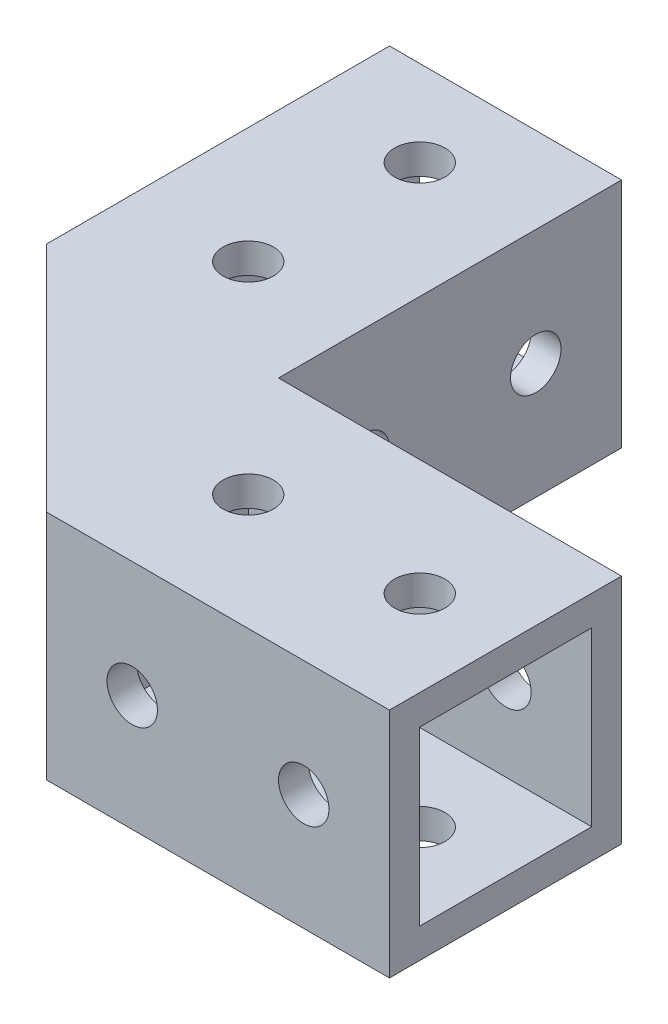
ISO-10303-21;
HEADER;
FILE_DESCRIPTION(('STEP AP214'),'2;1');
FILE_NAME('part.step','',(''),(''),'','','');
FILE_SCHEMA(('AUTOMOTIVE_DESIGN { 1 0 10303 214 1 1 1 1 }'));
ENDSEC;
DATA;
#1=APPLICATION_CONTEXT('core data for automotive mechanical design processes');
#2=APPLICATION_PROTOCOL_DEFINITION('international standard','automotive_design',2000,#1);
#3=PRODUCT_CONTEXT('',#1,'mechanical');
#4=PRODUCT('Part','Part','',(#3));
#5=PRODUCT_RELATED_PRODUCT_CATEGORY('part','',(#4));
#6=PRODUCT_DEFINITION_FORMATION('','',#4);
#7=PRODUCT_DEFINITION_CONTEXT('part definition',#1,'design');
#8=PRODUCT_DEFINITION('design','',#6,#7);
#9=PRODUCT_DEFINITION_SHAPE('','',#8);
#10=(LENGTH_UNIT() NAMED_UNIT(*) SI_UNIT(.MILLI.,.METRE.));
#11=(NAMED_UNIT(*) PLANE_ANGLE_UNIT() SI_UNIT($,.RADIAN.));
#12=(NAMED_UNIT(*) SI_UNIT($,.STERADIAN.) SOLID_ANGLE_UNIT());
#13=UNCERTAINTY_MEASURE_WITH_UNIT(LENGTH_MEASURE(1.E-05),#10,'distance_accuracy_value','');
#14=(GEOMETRIC_REPRESENTATION_CONTEXT(3) GLOBAL_UNCERTAINTY_ASSIGNED_CONTEXT((#13)) GLOBAL_UNIT_ASSIGNED_CONTEXT((#10,
#11,#12)) REPRESENTATION_CONTEXT('',''));
#15=CARTESIAN_POINT('',(0.,0.,0.));
#16=DIRECTION('',(0.,0.,1.));
#17=DIRECTION('',(1.,0.,0.));
#18=AXIS2_PLACEMENT_3D('',#15,#16,#17);
#19=CARTESIAN_POINT('',(0.,23.,0.));
#20=DIRECTION('',(0.,0.,1.));
#21=DIRECTION('',(1.,0.,0.));
#22=AXIS2_PLACEMENT_3D('',#19,#20,#21);
#23=PLANE('',#22);
#24=CARTESIAN_POINT('',(8.49999999999997,11.5,0.));
#25=DIRECTION('',(0.,0.,-1.));
#26=DIRECTION('',(-1.,0.,0.));
#27=AXIS2_PLACEMENT_3D('',#24,#25,#26);
#28=CIRCLE('',#27,2.5);
#29=CARTESIAN_POINT('',(5.99999999999997,11.5,0.));
#30=VERTEX_POINT('',#29);
#31=EDGE_CURVE('E368',#30,#30,#28,.T.);
#32=ORIENTED_EDGE('',*,*,#31,.F.);
#33=EDGE_LOOP('',(#32));
#34=FACE_BOUND('',#33,.T.);
#35=CARTESIAN_POINT('',(25.5,11.5,0.));
#36=DIRECTION('',(0.,0.,-1.));
#37=DIRECTION('',(-1.,0.,0.));
#38=AXIS2_PLACEMENT_3D('',#35,#36,#37);
#39=CIRCLE('',#38,2.5);
#40=CARTESIAN_POINT('',(23.,11.5,0.));
#41=VERTEX_POINT('',#40);
#42=EDGE_CURVE('E371',#41,#41,#39,.T.);
#43=ORIENTED_EDGE('',*,*,#42,.F.);
#44=EDGE_LOOP('',(#43));
#45=FACE_BOUND('',#44,.T.);
#46=DIRECTION('',(1.,0.,0.));
#47=VECTOR('',#46,1.);
#48=CARTESIAN_POINT('',(0.,4.,0.));
#49=LINE('',#48,#47);
#50=CARTESIAN_POINT('',(0.,4.,0.));
#51=VERTEX_POINT('',#50);
#52=CARTESIAN_POINT('',(17.,4.,0.));
#53=VERTEX_POINT('',#52);
#54=EDGE_CURVE('E180',#51,#53,#49,.T.);
#55=ORIENTED_EDGE('',*,*,#54,.F.);
#56=DIRECTION('',(0.,-1.,0.));
#57=VECTOR('',#56,1.);
#58=CARTESIAN_POINT('',(0.,23.,0.));
#59=LINE('',#58,#57);
#60=CARTESIAN_POINT('',(0.,23.,0.));
#61=VERTEX_POINT('',#60);
#62=EDGE_CURVE('E289',#61,#51,#59,.T.);
#63=ORIENTED_EDGE('',*,*,#62,.F.);
#64=DIRECTION('',(-1.,0.,0.));
#65=VECTOR('',#64,1.);
#66=CARTESIAN_POINT('',(0.,23.,0.));
#67=LINE('',#66,#65);
#68=CARTESIAN_POINT('',(34.,23.,0.));
#69=VERTEX_POINT('',#68);
#70=EDGE_CURVE('E396',#69,#61,#67,.T.);
#71=ORIENTED_EDGE('',*,*,#70,.F.);
#72=DIRECTION('',(0.,-1.,0.));
#73=VECTOR('',#72,1.);
#74=CARTESIAN_POINT('',(34.,23.,0.));
#75=LINE('',#74,#73);
#76=CARTESIAN_POINT('',(34.,0.,0.));
#77=VERTEX_POINT('',#76);
#78=EDGE_CURVE('E399',#69,#77,#75,.T.);
#79=ORIENTED_EDGE('',*,*,#78,.T.);
#80=DIRECTION('',(-1.,0.,0.));
#81=VECTOR('',#80,1.);
#82=CARTESIAN_POINT('',(0.,0.,0.));
#83=LINE('',#82,#81);
#84=CARTESIAN_POINT('',(17.,0.,0.));
#85=VERTEX_POINT('',#84);
#86=EDGE_CURVE('E67',#77,#85,#83,.T.);
#87=ORIENTED_EDGE('',*,*,#86,.T.);
#88=DIRECTION('',(0.,-1.,0.));
#89=VECTOR('',#88,1.);
#90=CARTESIAN_POINT('',(17.,4.,0.));
#91=LINE('',#90,#89);
#92=EDGE_CURVE('E62',#53,#85,#91,.T.);
#93=ORIENTED_EDGE('',*,*,#92,.F.);
#94=EDGE_LOOP('',(#55,#63,#71,#79,#87,#93));
#95=FACE_BOUND('',#94,.T.);
#96=ADVANCED_FACE('F45',(#34,#45,#95),#23,.F.);
#97=CARTESIAN_POINT('',(0.,23.,0.));
#98=DIRECTION('',(-1.,0.,0.));
#99=DIRECTION('',(0.,0.,-1.));
#100=AXIS2_PLACEMENT_3D('',#97,#98,#99);
#101=PLANE('',#100);
#102=CARTESIAN_POINT('',(-1.07580611086178E-13,11.5,-25.5));
#103=DIRECTION('',(-1.,0.,0.));
#104=DIRECTION('',(0.,0.,1.));
#105=AXIS2_PLACEMENT_3D('',#102,#103,#104);
#106=CIRCLE('',#105,2.5);
#107=CARTESIAN_POINT('',(0.,11.5,-23.));
#108=VERTEX_POINT('',#107);
#109=EDGE_CURVE('E258',#108,#108,#106,.T.);
#110=ORIENTED_EDGE('',*,*,#109,.T.);
#111=EDGE_LOOP('',(#110));
#112=FACE_BOUND('',#111,.T.);
#113=CARTESIAN_POINT('',(0.,11.5,-8.49999999999997));
#114=DIRECTION('',(-1.,0.,0.));
#115=DIRECTION('',(0.,0.,1.));
#116=AXIS2_PLACEMENT_3D('',#113,#114,#115);
#117=CIRCLE('',#116,2.5);
#118=CARTESIAN_POINT('',(0.,11.5,-5.99999999999997));
#119=VERTEX_POINT('',#118);
#120=EDGE_CURVE('E255',#119,#119,#117,.T.);
#121=ORIENTED_EDGE('',*,*,#120,.T.);
#122=EDGE_LOOP('',(#121));
#123=FACE_BOUND('',#122,.T.);
#124=DIRECTION('',(0.,0.,1.));
#125=VECTOR('',#124,1.);
#126=CARTESIAN_POINT('',(-1.43982048506075E-13,4.,-17.));
#127=LINE('',#126,#125);
#128=CARTESIAN_POINT('',(-1.43982048506075E-13,4.,-17.));
#129=VERTEX_POINT('',#128);
#130=EDGE_CURVE('E193',#129,#51,#127,.T.);
#131=ORIENTED_EDGE('',*,*,#130,.F.);
#132=DIRECTION('',(0.,-1.,0.));
#133=VECTOR('',#132,1.);
#134=CARTESIAN_POINT('',(-1.43982048506075E-13,4.,-17.));
#135=LINE('',#134,#133);
#136=CARTESIAN_POINT('',(0.,0.,-16.9999999999999));
#137=VERTEX_POINT('',#136);
#138=EDGE_CURVE('E190',#129,#137,#135,.T.);
#139=ORIENTED_EDGE('',*,*,#138,.T.);
#140=DIRECTION('',(0.,0.,1.));
#141=VECTOR('',#140,1.);
#142=CARTESIAN_POINT('',(0.,0.,0.));
#143=LINE('',#142,#141);
#144=CARTESIAN_POINT('',(-1.4344081478157E-13,0.,-34.));
#145=VERTEX_POINT('',#144);
#146=EDGE_CURVE('E283',#145,#137,#143,.T.);
#147=ORIENTED_EDGE('',*,*,#146,.F.);
#148=DIRECTION('',(0.,-1.,0.));
#149=VECTOR('',#148,1.);
#150=CARTESIAN_POINT('',(-1.4344081478157E-13,23.,-34.));
#151=LINE('',#150,#149);
#152=CARTESIAN_POINT('',(-1.4344081478157E-13,23.,-34.));
#153=VERTEX_POINT('',#152);
#154=EDGE_CURVE('E299',#153,#145,#151,.T.);
#155=ORIENTED_EDGE('',*,*,#154,.F.);
#156=DIRECTION('',(0.,0.,1.));
#157=VECTOR('',#156,1.);
#158=CARTESIAN_POINT('',(0.,23.,0.));
#159=LINE('',#158,#157);
#160=EDGE_CURVE('E286',#153,#61,#159,.T.);
#161=ORIENTED_EDGE('',*,*,#160,.T.);
#162=ORIENTED_EDGE('',*,*,#62,.T.);
#163=EDGE_LOOP('',(#131,#139,#147,#155,#161,#162));
#164=FACE_BOUND('',#163,.T.);
#165=ADVANCED_FACE('F450',(#112,#123,#164),#101,.F.);
#166=CARTESIAN_POINT('',(8.5,23.,11.5));
#167=DIRECTION('',(0.,-1.,0.));
#168=DIRECTION('',(0.,0.,-1.));
#169=AXIS2_PLACEMENT_3D('',#166,#167,#168);
#170=CYLINDRICAL_SURFACE('',#169,2.5);
#171=CARTESIAN_POINT('',(8.5,20.04,11.5));
#172=DIRECTION('',(0.,1.,0.));
#173=DIRECTION('',(0.,0.,1.));
#174=AXIS2_PLACEMENT_3D('',#171,#172,#173);
#175=CIRCLE('',#174,2.5);
#176=CARTESIAN_POINT('',(8.5,20.04,14.));
#177=VERTEX_POINT('',#176);
#178=EDGE_CURVE('E364',#177,#177,#175,.T.);
#179=ORIENTED_EDGE('',*,*,#178,.F.);
#180=EDGE_LOOP('',(#179));
#181=FACE_BOUND('',#180,.T.);
#182=CARTESIAN_POINT('',(8.5,23.,11.5));
#183=DIRECTION('',(0.,1.,0.));
#184=DIRECTION('',(0.,0.,1.));
#185=AXIS2_PLACEMENT_3D('',#182,#183,#184);
#186=CIRCLE('',#185,2.5);
#187=CARTESIAN_POINT('',(8.5,23.,14.));
#188=VERTEX_POINT('',#187);
#189=EDGE_CURVE('E386',#188,#188,#186,.T.);
#190=ORIENTED_EDGE('',*,*,#189,.T.);
#191=EDGE_LOOP('',(#190));
#192=FACE_BOUND('',#191,.T.);
#193=ADVANCED_FACE('F490',(#181,#192),#170,.F.);
#194=CARTESIAN_POINT('',(25.5,23.,11.5));
#195=DIRECTION('',(0.,-1.,0.));
#196=DIRECTION('',(0.,0.,-1.));
#197=AXIS2_PLACEMENT_3D('',#194,#195,#196);
#198=CYLINDRICAL_SURFACE('',#197,2.5);
#199=CARTESIAN_POINT('',(25.5,20.04,11.5));
#200=DIRECTION('',(0.,1.,0.));
#201=DIRECTION('',(0.,0.,1.));
#202=AXIS2_PLACEMENT_3D('',#199,#200,#201);
#203=CIRCLE('',#202,2.5);
#204=CARTESIAN_POINT('',(25.5,20.04,14.));
#205=VERTEX_POINT('',#204);
#206=EDGE_CURVE('E361',#205,#205,#203,.T.);
#207=ORIENTED_EDGE('',*,*,#206,.F.);
#208=EDGE_LOOP('',(#207));
#209=FACE_BOUND('',#208,.T.);
#210=CARTESIAN_POINT('',(25.5,23.,11.5));
#211=DIRECTION('',(0.,1.,0.));
#212=DIRECTION('',(0.,0.,1.));
#213=AXIS2_PLACEMENT_3D('',#210,#211,#212);
#214=CIRCLE('',#213,2.5);
#215=CARTESIAN_POINT('',(25.5,23.,14.));
#216=VERTEX_POINT('',#215);
#217=EDGE_CURVE('E380',#216,#216,#214,.T.);
#218=ORIENTED_EDGE('',*,*,#217,.T.);
#219=EDGE_LOOP('',(#218));
#220=FACE_BOUND('',#219,.T.);
#221=ADVANCED_FACE('F567',(#209,#220),#198,.F.);
#222=CARTESIAN_POINT('',(0.,23.,0.));
#223=DIRECTION('',(0.,1.,0.));
#224=DIRECTION('',(0.,0.,1.));
#225=AXIS2_PLACEMENT_3D('',#222,#223,#224);
#226=PLANE('',#225);
#227=ORIENTED_EDGE('',*,*,#189,.F.);
#228=EDGE_LOOP('',(#227));
#229=FACE_BOUND('',#228,.T.);
#230=ORIENTED_EDGE('',*,*,#70,.T.);
#231=ORIENTED_EDGE('',*,*,#160,.F.);
#232=DIRECTION('',(1.,0.,0.));
#233=VECTOR('',#232,1.);
#234=CARTESIAN_POINT('',(-1.4344081478157E-13,23.,-34.));
#235=LINE('',#234,#233);
#236=CARTESIAN_POINT('',(-23.0000000000001,23.,-33.9999999999999));
#237=VERTEX_POINT('',#236);
#238=EDGE_CURVE('E282',#237,#153,#235,.T.);
#239=ORIENTED_EDGE('',*,*,#238,.F.);
#240=DIRECTION('',(0.,0.,-1.));
#241=VECTOR('',#240,1.);
#242=CARTESIAN_POINT('',(-23.,23.,0.));
#243=LINE('',#242,#241);
#244=CARTESIAN_POINT('',(-23.,23.,0.));
#245=VERTEX_POINT('',#244);
#246=EDGE_CURVE('E279',#245,#237,#243,.T.);
#247=ORIENTED_EDGE('',*,*,#246,.F.);
#248=DIRECTION('',(0.707106781186549,0.,0.707106781186546));
#249=VECTOR('',#248,1.);
#250=CARTESIAN_POINT('',(-23.,23.,0.));
#251=LINE('',#250,#249);
#252=CARTESIAN_POINT('',(0.,23.,23.));
#253=VERTEX_POINT('',#252);
#254=EDGE_CURVE('E310',#245,#253,#251,.T.);
#255=ORIENTED_EDGE('',*,*,#254,.T.);
#256=DIRECTION('',(1.,0.,0.));
#257=VECTOR('',#256,1.);
#258=CARTESIAN_POINT('',(0.,23.,23.));
#259=LINE('',#258,#257);
#260=CARTESIAN_POINT('',(34.,23.,23.));
#261=VERTEX_POINT('',#260);
#262=EDGE_CURVE('E392',#253,#261,#259,.T.);
#263=ORIENTED_EDGE('',*,*,#262,.T.);
#264=DIRECTION('',(0.,0.,-1.));
#265=VECTOR('',#264,1.);
#266=CARTESIAN_POINT('',(34.,23.,0.));
#267=LINE('',#266,#265);
#268=EDGE_CURVE('E394',#261,#69,#267,.T.);
#269=ORIENTED_EDGE('',*,*,#268,.T.);
#270=EDGE_LOOP('',(#230,#231,#239,#247,#255,#263,#269));
#271=FACE_BOUND('',#270,.T.);
#272=ORIENTED_EDGE('',*,*,#217,.F.);
#273=EDGE_LOOP('',(#272));
#274=FACE_BOUND('',#273,.T.);
#275=CARTESIAN_POINT('',(-11.5,23.,-8.49999999999996));
#276=DIRECTION('',(0.,-1.,0.));
#277=DIRECTION('',(-1.,0.,0.));
#278=AXIS2_PLACEMENT_3D('',#275,#276,#277);
#279=CIRCLE('',#278,2.5);
#280=CARTESIAN_POINT('',(-14.,23.,-8.49999999999995));
#281=VERTEX_POINT('',#280);
#282=EDGE_CURVE('E273',#281,#281,#279,.T.);
#283=ORIENTED_EDGE('',*,*,#282,.T.);
#284=EDGE_LOOP('',(#283));
#285=FACE_BOUND('',#284,.T.);
#286=CARTESIAN_POINT('',(-11.5000000000001,23.,-25.5));
#287=DIRECTION('',(0.,-1.,0.));
#288=DIRECTION('',(-1.,0.,0.));
#289=AXIS2_PLACEMENT_3D('',#286,#287,#288);
#290=CIRCLE('',#289,2.5);
#291=CARTESIAN_POINT('',(-14.0000000000001,23.,-25.4999999999999));
#292=VERTEX_POINT('',#291);
#293=EDGE_CURVE('E267',#292,#292,#290,.T.);
#294=ORIENTED_EDGE('',*,*,#293,.T.);
#295=EDGE_LOOP('',(#294));
#296=FACE_BOUND('',#295,.T.);
#297=ADVANCED_FACE('F454',(#229,#271,#274,#285,#296),#226,.T.);
#298=CARTESIAN_POINT('',(0.,0.,0.));
#299=DIRECTION('',(0.,1.,0.));
#300=DIRECTION('',(0.,0.,1.));
#301=AXIS2_PLACEMENT_3D('',#298,#299,#300);
#302=PLANE('',#301);
#303=DIRECTION('',(-0.689736149918452,0.,-0.7240608009661));
#304=VECTOR('',#303,1.);
#305=CARTESIAN_POINT('',(8.70636593799587,0.,-8.7063659379959));
#306=LINE('',#305,#304);
#307=CARTESIAN_POINT('',(8.70636593799587,0.,-8.7063659379959));
#308=VERTEX_POINT('',#307);
#309=EDGE_CURVE('E186',#85,#308,#306,.T.);
#310=ORIENTED_EDGE('',*,*,#309,.F.);
#311=ORIENTED_EDGE('',*,*,#86,.F.);
#312=DIRECTION('',(0.,0.,-1.));
#313=VECTOR('',#312,1.);
#314=CARTESIAN_POINT('',(34.,0.,0.));
#315=LINE('',#314,#313);
#316=CARTESIAN_POINT('',(34.,0.,23.));
#317=VERTEX_POINT('',#316);
#318=EDGE_CURVE('E401',#317,#77,#315,.T.);
#319=ORIENTED_EDGE('',*,*,#318,.F.);
#320=DIRECTION('',(1.,0.,0.));
#321=VECTOR('',#320,1.);
#322=CARTESIAN_POINT('',(0.,0.,23.));
#323=LINE('',#322,#321);
#324=CARTESIAN_POINT('',(0.,0.,23.));
#325=VERTEX_POINT('',#324);
#326=EDGE_CURVE('E389',#325,#317,#323,.T.);
#327=ORIENTED_EDGE('',*,*,#326,.F.);
#328=DIRECTION('',(0.707106781186549,0.,0.707106781186546));
#329=VECTOR('',#328,1.);
#330=CARTESIAN_POINT('',(-23.,0.,0.));
#331=LINE('',#330,#329);
#332=CARTESIAN_POINT('',(-23.,0.,0.));
#333=VERTEX_POINT('',#332);
#334=EDGE_CURVE('E303',#333,#325,#331,.T.);
#335=ORIENTED_EDGE('',*,*,#334,.F.);
#336=DIRECTION('',(0.,0.,-1.));
#337=VECTOR('',#336,1.);
#338=CARTESIAN_POINT('',(-23.,0.,0.));
#339=LINE('',#338,#337);
#340=CARTESIAN_POINT('',(-23.0000000000001,0.,-33.9999999999999));
#341=VERTEX_POINT('',#340);
#342=EDGE_CURVE('E276',#333,#341,#339,.T.);
#343=ORIENTED_EDGE('',*,*,#342,.T.);
#344=DIRECTION('',(1.,0.,0.));
#345=VECTOR('',#344,1.);
#346=CARTESIAN_POINT('',(-1.4344081478157E-13,0.,-34.));
#347=LINE('',#346,#345);
#348=EDGE_CURVE('E292',#341,#145,#347,.T.);
#349=ORIENTED_EDGE('',*,*,#348,.T.);
#350=ORIENTED_EDGE('',*,*,#146,.T.);
#351=DIRECTION('',(-0.724060800966106,0.,-0.689736149918446));
#352=VECTOR('',#351,1.);
#353=CARTESIAN_POINT('',(8.70636593799587,0.,-8.7063659379959));
#354=LINE('',#353,#352);
#355=EDGE_CURVE('E199',#308,#137,#354,.T.);
#356=ORIENTED_EDGE('',*,*,#355,.F.);
#357=EDGE_LOOP('',(#310,#311,#319,#327,#335,#343,#349,#350,#356));
#358=FACE_BOUND('',#357,.T.);
#359=CARTESIAN_POINT('',(8.5,0.,11.5));
#360=DIRECTION('',(0.,1.,0.));
#361=DIRECTION('',(0.,0.,1.));
#362=AXIS2_PLACEMENT_3D('',#359,#360,#361);
#363=CIRCLE('',#362,2.5);
#364=CARTESIAN_POINT('',(8.5,0.,14.));
#365=VERTEX_POINT('',#364);
#366=EDGE_CURVE('E383',#365,#365,#363,.T.);
#367=ORIENTED_EDGE('',*,*,#366,.T.);
#368=EDGE_LOOP('',(#367));
#369=FACE_BOUND('',#368,.T.);
#370=CARTESIAN_POINT('',(25.5,0.,11.5));
#371=DIRECTION('',(0.,1.,0.));
#372=DIRECTION('',(0.,0.,1.));
#373=AXIS2_PLACEMENT_3D('',#370,#371,#372);
#374=CIRCLE('',#373,2.5);
#375=CARTESIAN_POINT('',(25.5,0.,14.));
#376=VERTEX_POINT('',#375);
#377=EDGE_CURVE('E377',#376,#376,#374,.T.);
#378=ORIENTED_EDGE('',*,*,#377,.T.);
#379=EDGE_LOOP('',(#378));
#380=FACE_BOUND('',#379,.T.);
#381=CARTESIAN_POINT('',(-11.5,0.,-8.49999999999996));
#382=DIRECTION('',(0.,-1.,0.));
#383=DIRECTION('',(-1.,0.,0.));
#384=AXIS2_PLACEMENT_3D('',#381,#382,#383);
#385=CIRCLE('',#384,2.5);
#386=CARTESIAN_POINT('',(-14.,0.,-8.49999999999995));
#387=VERTEX_POINT('',#386);
#388=EDGE_CURVE('E270',#387,#387,#385,.T.);
#389=ORIENTED_EDGE('',*,*,#388,.F.);
#390=EDGE_LOOP('',(#389));
#391=FACE_BOUND('',#390,.T.);
#392=CARTESIAN_POINT('',(-11.5000000000001,0.,-25.5));
#393=DIRECTION('',(0.,-1.,0.));
#394=DIRECTION('',(-1.,0.,0.));
#395=AXIS2_PLACEMENT_3D('',#392,#393,#394);
#396=CIRCLE('',#395,2.5);
#397=CARTESIAN_POINT('',(-14.0000000000001,0.,-25.4999999999999));
#398=VERTEX_POINT('',#397);
#399=EDGE_CURVE('E264',#398,#398,#396,.T.);
#400=ORIENTED_EDGE('',*,*,#399,.F.);
#401=EDGE_LOOP('',(#400));
#402=FACE_BOUND('',#401,.T.);
#403=CARTESIAN_POINT('',(5.17083203206314,0.,-5.17083203206316));
#404=DIRECTION('',(0.,1.,0.));
#405=DIRECTION('',(0.,0.,1.));
#406=AXIS2_PLACEMENT_3D('',#403,#404,#405);
#407=CIRCLE('',#406,2.5);
#408=CARTESIAN_POINT('',(5.17083203206314,0.,-2.67083203206316));
#409=VERTEX_POINT('',#408);
#410=EDGE_CURVE('E847',#409,#409,#407,.T.);
#411=ORIENTED_EDGE('',*,*,#410,.T.);
#412=EDGE_LOOP('',(#411));
#413=FACE_BOUND('',#412,.T.);
#414=ADVANCED_FACE('F437',(#358,#369,#380,#391,#402,#413),#302,.F.);
#415=CARTESIAN_POINT('',(0.,23.,23.));
#416=DIRECTION('',(0.,0.,-1.));
#417=DIRECTION('',(-1.,0.,0.));
#418=AXIS2_PLACEMENT_3D('',#415,#416,#417);
#419=PLANE('',#418);
#420=CARTESIAN_POINT('',(8.49999999999997,11.5,23.));
#421=DIRECTION('',(0.,0.,-1.));
#422=DIRECTION('',(-1.,0.,0.));
#423=AXIS2_PLACEMENT_3D('',#420,#421,#422);
#424=CIRCLE('',#423,2.5);
#425=CARTESIAN_POINT('',(5.99999999999997,11.5,23.));
#426=VERTEX_POINT('',#425);
#427=EDGE_CURVE('E367',#426,#426,#424,.T.);
#428=ORIENTED_EDGE('',*,*,#427,.T.);
#429=EDGE_LOOP('',(#428));
#430=FACE_BOUND('',#429,.T.);
#431=CARTESIAN_POINT('',(25.5,11.5,23.));
#432=DIRECTION('',(0.,0.,-1.));
#433=DIRECTION('',(-1.,0.,0.));
#434=AXIS2_PLACEMENT_3D('',#431,#432,#433);
#435=CIRCLE('',#434,2.5);
#436=CARTESIAN_POINT('',(23.,11.5,23.));
#437=VERTEX_POINT('',#436);
#438=EDGE_CURVE('E374',#437,#437,#435,.T.);
#439=ORIENTED_EDGE('',*,*,#438,.T.);
#440=EDGE_LOOP('',(#439));
#441=FACE_BOUND('',#440,.T.);
#442=ORIENTED_EDGE('',*,*,#326,.T.);
#443=DIRECTION('',(0.,-1.,0.));
#444=VECTOR('',#443,1.);
#445=CARTESIAN_POINT('',(34.,23.,23.));
#446=LINE('',#445,#444);
#447=EDGE_CURVE('E54',#261,#317,#446,.T.);
#448=ORIENTED_EDGE('',*,*,#447,.F.);
#449=ORIENTED_EDGE('',*,*,#262,.F.);
#450=DIRECTION('',(0.,-1.,0.));
#451=VECTOR('',#450,1.);
#452=CARTESIAN_POINT('',(0.,23.,23.));
#453=LINE('',#452,#451);
#454=EDGE_CURVE('E12',#253,#325,#453,.T.);
#455=ORIENTED_EDGE('',*,*,#454,.T.);
#456=EDGE_LOOP('',(#442,#448,#449,#455));
#457=FACE_BOUND('',#456,.T.);
#458=ADVANCED_FACE('F47',(#430,#441,#457),#419,.F.);
#459=CARTESIAN_POINT('',(34.,23.,0.));
#460=DIRECTION('',(-1.,0.,0.));
#461=DIRECTION('',(0.,0.,1.));
#462=AXIS2_PLACEMENT_3D('',#459,#460,#461);
#463=PLANE('',#462);
#464=DIRECTION('',(0.,0.,1.));
#465=VECTOR('',#464,1.);
#466=CARTESIAN_POINT('',(34.,20.04,20.04));
#467=LINE('',#466,#465);
#468=CARTESIAN_POINT('',(34.,20.04,2.96));
#469=VERTEX_POINT('',#468);
#470=CARTESIAN_POINT('',(34.,20.04,20.04));
#471=VERTEX_POINT('',#470);
#472=EDGE_CURVE('E334',#469,#471,#467,.T.);
#473=ORIENTED_EDGE('',*,*,#472,.F.);
#474=DIRECTION('',(0.,1.,0.));
#475=VECTOR('',#474,1.);
#476=CARTESIAN_POINT('',(34.,20.04,2.96));
#477=LINE('',#476,#475);
#478=CARTESIAN_POINT('',(34.,2.96,2.96));
#479=VERTEX_POINT('',#478);
#480=EDGE_CURVE('E318',#479,#469,#477,.T.);
#481=ORIENTED_EDGE('',*,*,#480,.F.);
#482=DIRECTION('',(0.,0.,-1.));
#483=VECTOR('',#482,1.);
#484=CARTESIAN_POINT('',(34.,2.96,20.04));
#485=LINE('',#484,#483);
#486=CARTESIAN_POINT('',(34.,2.96,20.04));
#487=VERTEX_POINT('',#486);
#488=EDGE_CURVE('E323',#487,#479,#485,.T.);
#489=ORIENTED_EDGE('',*,*,#488,.F.);
#490=DIRECTION('',(0.,-1.,0.));
#491=VECTOR('',#490,1.);
#492=CARTESIAN_POINT('',(34.,20.04,20.04));
#493=LINE('',#492,#491);
#494=EDGE_CURVE('E337',#471,#487,#493,.T.);
#495=ORIENTED_EDGE('',*,*,#494,.F.);
#496=EDGE_LOOP('',(#473,#481,#489,#495));
#497=FACE_BOUND('',#496,.T.);
#498=ORIENTED_EDGE('',*,*,#318,.T.);
#499=ORIENTED_EDGE('',*,*,#78,.F.);
#500=ORIENTED_EDGE('',*,*,#268,.F.);
#501=ORIENTED_EDGE('',*,*,#447,.T.);
#502=EDGE_LOOP('',(#498,#499,#500,#501));
#503=FACE_BOUND('',#502,.T.);
#504=ADVANCED_FACE('F436',(#497,#503),#463,.F.);
#505=CARTESIAN_POINT('',(8.5,2.96,11.5));
#506=DIRECTION('',(0.,-1.,0.));
#507=DIRECTION('',(0.,0.,-1.));
#508=AXIS2_PLACEMENT_3D('',#505,#506,#507);
#509=CIRCLE('',#508,2.5);
#510=CARTESIAN_POINT('',(8.5,2.96,9.));
#511=VERTEX_POINT('',#510);
#512=EDGE_CURVE('E358',#511,#511,#509,.T.);
#513=ORIENTED_EDGE('',*,*,#512,.F.);
#514=EDGE_LOOP('',(#513));
#515=FACE_BOUND('',#514,.T.);
#516=ORIENTED_EDGE('',*,*,#366,.F.);
#517=EDGE_LOOP('',(#516));
#518=FACE_BOUND('',#517,.T.);
#519=ADVANCED_FACE('F579',(#515,#518),#170,.F.);
#520=CARTESIAN_POINT('',(25.5,2.96,11.5));
#521=DIRECTION('',(0.,-1.,0.));
#522=DIRECTION('',(0.,0.,-1.));
#523=AXIS2_PLACEMENT_3D('',#520,#521,#522);
#524=CIRCLE('',#523,2.5);
#525=CARTESIAN_POINT('',(25.5,2.96,9.));
#526=VERTEX_POINT('',#525);
#527=EDGE_CURVE('E49',#526,#526,#524,.T.);
#528=ORIENTED_EDGE('',*,*,#527,.F.);
#529=EDGE_LOOP('',(#528));
#530=FACE_BOUND('',#529,.T.);
#531=ORIENTED_EDGE('',*,*,#377,.F.);
#532=EDGE_LOOP('',(#531));
#533=FACE_BOUND('',#532,.T.);
#534=ADVANCED_FACE('F430',(#530,#533),#198,.F.);
#535=CARTESIAN_POINT('',(25.5,11.5,23.));
#536=DIRECTION('',(0.,0.,-1.));
#537=DIRECTION('',(-1.,0.,0.));
#538=AXIS2_PLACEMENT_3D('',#535,#536,#537);
#539=CYLINDRICAL_SURFACE('',#538,2.5);
#540=CARTESIAN_POINT('',(25.5,11.5,20.04));
#541=DIRECTION('',(0.,0.,1.));
#542=DIRECTION('',(1.,0.,0.));
#543=AXIS2_PLACEMENT_3D('',#540,#541,#542);
#544=CIRCLE('',#543,2.5);
#545=CARTESIAN_POINT('',(28.,11.5,20.04));
#546=VERTEX_POINT('',#545);
#547=EDGE_CURVE('E355',#546,#546,#544,.F.);
#548=ORIENTED_EDGE('',*,*,#547,.T.);
#549=EDGE_LOOP('',(#548));
#550=FACE_BOUND('',#549,.T.);
#551=ORIENTED_EDGE('',*,*,#438,.F.);
#552=EDGE_LOOP('',(#551));
#553=FACE_BOUND('',#552,.T.);
#554=ADVANCED_FACE('F426',(#550,#553),#539,.F.);
#555=CARTESIAN_POINT('',(25.5,11.5,2.96));
#556=DIRECTION('',(0.,0.,-1.));
#557=DIRECTION('',(0.,1.,0.));
#558=AXIS2_PLACEMENT_3D('',#555,#556,#557);
#559=CIRCLE('',#558,2.5);
#560=CARTESIAN_POINT('',(25.5,14.,2.96));
#561=VERTEX_POINT('',#560);
#562=EDGE_CURVE('E351',#561,#561,#559,.F.);
#563=ORIENTED_EDGE('',*,*,#562,.T.);
#564=EDGE_LOOP('',(#563));
#565=FACE_BOUND('',#564,.T.);
#566=ORIENTED_EDGE('',*,*,#42,.T.);
#567=EDGE_LOOP('',(#566));
#568=FACE_BOUND('',#567,.T.);
#569=ADVANCED_FACE('F429',(#565,#568),#539,.F.);
#570=CARTESIAN_POINT('',(8.49999999999997,11.5,23.));
#571=DIRECTION('',(0.,0.,-1.));
#572=DIRECTION('',(-1.,0.,0.));
#573=AXIS2_PLACEMENT_3D('',#570,#571,#572);
#574=CYLINDRICAL_SURFACE('',#573,2.5);
#575=CARTESIAN_POINT('',(8.49999999999997,11.5,20.04));
#576=DIRECTION('',(0.,0.,1.));
#577=DIRECTION('',(1.,0.,0.));
#578=AXIS2_PLACEMENT_3D('',#575,#576,#577);
#579=CIRCLE('',#578,2.5);
#580=CARTESIAN_POINT('',(11.,11.5,20.04));
#581=VERTEX_POINT('',#580);
#582=EDGE_CURVE('E354',#581,#581,#579,.F.);
#583=ORIENTED_EDGE('',*,*,#582,.T.);
#584=EDGE_LOOP('',(#583));
#585=FACE_BOUND('',#584,.T.);
#586=ORIENTED_EDGE('',*,*,#427,.F.);
#587=EDGE_LOOP('',(#586));
#588=FACE_BOUND('',#587,.T.);
#589=ADVANCED_FACE('F411',(#585,#588),#574,.F.);
#590=CARTESIAN_POINT('',(8.49999999999997,11.5,2.96));
#591=DIRECTION('',(0.,0.,-1.));
#592=DIRECTION('',(0.,1.,0.));
#593=AXIS2_PLACEMENT_3D('',#590,#591,#592);
#594=CIRCLE('',#593,2.5);
#595=CARTESIAN_POINT('',(8.49999999999997,14.,2.96));
#596=VERTEX_POINT('',#595);
#597=EDGE_CURVE('E344',#596,#596,#594,.F.);
#598=ORIENTED_EDGE('',*,*,#597,.T.);
#599=EDGE_LOOP('',(#598));
#600=FACE_BOUND('',#599,.T.);
#601=ORIENTED_EDGE('',*,*,#31,.T.);
#602=EDGE_LOOP('',(#601));
#603=FACE_BOUND('',#602,.T.);
#604=ADVANCED_FACE('F418',(#600,#603),#574,.F.);
#605=CARTESIAN_POINT('',(0.,20.04,20.04));
#606=DIRECTION('',(0.,0.,1.));
#607=DIRECTION('',(1.,0.,0.));
#608=AXIS2_PLACEMENT_3D('',#605,#606,#607);
#609=PLANE('',#608);
#610=ORIENTED_EDGE('',*,*,#582,.F.);
#611=EDGE_LOOP('',(#610));
#612=FACE_BOUND('',#611,.T.);
#613=ORIENTED_EDGE('',*,*,#494,.T.);
#614=DIRECTION('',(1.,0.,0.));
#615=VECTOR('',#614,1.);
#616=CARTESIAN_POINT('',(0.,2.96,20.04));
#617=LINE('',#616,#615);
#618=CARTESIAN_POINT('',(0.,2.96,20.04));
#619=VERTEX_POINT('',#618);
#620=EDGE_CURVE('E345',#619,#487,#617,.T.);
#621=ORIENTED_EDGE('',*,*,#620,.F.);
#622=DIRECTION('',(0.,-1.,0.));
#623=VECTOR('',#622,1.);
#624=CARTESIAN_POINT('',(0.,20.04,20.04));
#625=LINE('',#624,#623);
#626=CARTESIAN_POINT('',(0.,20.04,20.04));
#627=VERTEX_POINT('',#626);
#628=EDGE_CURVE('E326',#627,#619,#625,.T.);
#629=ORIENTED_EDGE('',*,*,#628,.F.);
#630=DIRECTION('',(1.,0.,0.));
#631=VECTOR('',#630,1.);
#632=CARTESIAN_POINT('',(0.,20.04,20.04));
#633=LINE('',#632,#631);
#634=EDGE_CURVE('E347',#627,#471,#633,.T.);
#635=ORIENTED_EDGE('',*,*,#634,.T.);
#636=EDGE_LOOP('',(#613,#621,#629,#635));
#637=FACE_BOUND('',#636,.T.);
#638=ORIENTED_EDGE('',*,*,#547,.F.);
#639=EDGE_LOOP('',(#638));
#640=FACE_BOUND('',#639,.T.);
#641=ADVANCED_FACE('F414',(#612,#637,#640),#609,.F.);
#642=CARTESIAN_POINT('',(0.,20.04,2.96));
#643=DIRECTION('',(0.,0.,-1.));
#644=DIRECTION('',(0.,1.,0.));
#645=AXIS2_PLACEMENT_3D('',#642,#643,#644);
#646=PLANE('',#645);
#647=ORIENTED_EDGE('',*,*,#597,.F.);
#648=EDGE_LOOP('',(#647));
#649=FACE_BOUND('',#648,.T.);
#650=ORIENTED_EDGE('',*,*,#480,.T.);
#651=DIRECTION('',(1.,0.,0.));
#652=VECTOR('',#651,1.);
#653=CARTESIAN_POINT('',(0.,20.04,2.96));
#654=LINE('',#653,#652);
#655=CARTESIAN_POINT('',(0.,20.04,2.96));
#656=VERTEX_POINT('',#655);
#657=EDGE_CURVE('E332',#656,#469,#654,.T.);
#658=ORIENTED_EDGE('',*,*,#657,.F.);
#659=DIRECTION('',(0.,1.,0.));
#660=VECTOR('',#659,1.);
#661=CARTESIAN_POINT('',(0.,20.04,2.96));
#662=LINE('',#661,#660);
#663=CARTESIAN_POINT('',(0.,2.96,2.96));
#664=VERTEX_POINT('',#663);
#665=EDGE_CURVE('E319',#664,#656,#662,.T.);
#666=ORIENTED_EDGE('',*,*,#665,.F.);
#667=DIRECTION('',(1.,0.,0.));
#668=VECTOR('',#667,1.);
#669=CARTESIAN_POINT('',(0.,2.96,2.96));
#670=LINE('',#669,#668);
#671=EDGE_CURVE('E342',#664,#479,#670,.T.);
#672=ORIENTED_EDGE('',*,*,#671,.T.);
#673=EDGE_LOOP('',(#650,#658,#666,#672));
#674=FACE_BOUND('',#673,.T.);
#675=ORIENTED_EDGE('',*,*,#562,.F.);
#676=EDGE_LOOP('',(#675));
#677=FACE_BOUND('',#676,.T.);
#678=ADVANCED_FACE('F417',(#649,#674,#677),#646,.F.);
#679=CARTESIAN_POINT('',(0.,2.96,20.04));
#680=DIRECTION('',(0.,-1.,0.));
#681=DIRECTION('',(0.,0.,-1.));
#682=AXIS2_PLACEMENT_3D('',#679,#680,#681);
#683=PLANE('',#682);
#684=ORIENTED_EDGE('',*,*,#512,.T.);
#685=EDGE_LOOP('',(#684));
#686=FACE_BOUND('',#685,.T.);
#687=ORIENTED_EDGE('',*,*,#527,.T.);
#688=EDGE_LOOP('',(#687));
#689=FACE_BOUND('',#688,.T.);
#690=ORIENTED_EDGE('',*,*,#488,.T.);
#691=ORIENTED_EDGE('',*,*,#671,.F.);
#692=DIRECTION('',(0.,0.,-1.));
#693=VECTOR('',#692,1.);
#694=CARTESIAN_POINT('',(0.,2.96,20.04));
#695=LINE('',#694,#693);
#696=EDGE_CURVE('E329',#619,#664,#695,.T.);
#697=ORIENTED_EDGE('',*,*,#696,.F.);
#698=ORIENTED_EDGE('',*,*,#620,.T.);
#699=EDGE_LOOP('',(#690,#691,#697,#698));
#700=FACE_BOUND('',#699,.T.);
#701=ADVANCED_FACE('F591',(#686,#689,#700),#683,.F.);
#702=CARTESIAN_POINT('',(0.,20.04,20.04));
#703=DIRECTION('',(0.,1.,0.));
#704=DIRECTION('',(0.,0.,1.));
#705=AXIS2_PLACEMENT_3D('',#702,#703,#704);
#706=PLANE('',#705);
#707=ORIENTED_EDGE('',*,*,#178,.T.);
#708=EDGE_LOOP('',(#707));
#709=FACE_BOUND('',#708,.T.);
#710=ORIENTED_EDGE('',*,*,#206,.T.);
#711=EDGE_LOOP('',(#710));
#712=FACE_BOUND('',#711,.T.);
#713=ORIENTED_EDGE('',*,*,#472,.T.);
#714=ORIENTED_EDGE('',*,*,#634,.F.);
#715=DIRECTION('',(0.,0.,1.));
#716=VECTOR('',#715,1.);
#717=CARTESIAN_POINT('',(0.,20.04,20.04));
#718=LINE('',#717,#716);
#719=EDGE_CURVE('E322',#656,#627,#718,.T.);
#720=ORIENTED_EDGE('',*,*,#719,.F.);
#721=ORIENTED_EDGE('',*,*,#657,.T.);
#722=EDGE_LOOP('',(#713,#714,#720,#721));
#723=FACE_BOUND('',#722,.T.);
#724=ADVANCED_FACE('F593',(#709,#712,#723),#706,.F.);
#725=CARTESIAN_POINT('',(0.,23.,0.));
#726=DIRECTION('',(-1.,0.,0.));
#727=DIRECTION('',(0.,0.,1.));
#728=AXIS2_PLACEMENT_3D('',#725,#726,#727);
#729=PLANE('',#728);
#730=ORIENTED_EDGE('',*,*,#628,.T.);
#731=ORIENTED_EDGE('',*,*,#696,.T.);
#732=ORIENTED_EDGE('',*,*,#665,.T.);
#733=ORIENTED_EDGE('',*,*,#719,.T.);
#734=EDGE_LOOP('',(#730,#731,#732,#733));
#735=FACE_BOUND('',#734,.T.);
#736=ADVANCED_FACE('F595',(#735),#729,.F.);
#737=CARTESIAN_POINT('',(-23.,23.,0.));
#738=DIRECTION('',(0.707106781186546,0.,-0.707106781186549));
#739=DIRECTION('',(-0.707106781186549,0.,-0.707106781186546));
#740=AXIS2_PLACEMENT_3D('',#737,#738,#739);
#741=PLANE('',#740);
#742=ORIENTED_EDGE('',*,*,#334,.T.);
#743=ORIENTED_EDGE('',*,*,#454,.F.);
#744=ORIENTED_EDGE('',*,*,#254,.F.);
#745=DIRECTION('',(0.,-1.,0.));
#746=VECTOR('',#745,1.);
#747=CARTESIAN_POINT('',(-23.,23.,0.));
#748=LINE('',#747,#746);
#749=EDGE_CURVE('E313',#245,#333,#748,.T.);
#750=ORIENTED_EDGE('',*,*,#749,.T.);
#751=EDGE_LOOP('',(#742,#743,#744,#750));
#752=FACE_BOUND('',#751,.T.);
#753=ADVANCED_FACE('F460',(#752),#741,.F.);
#754=CARTESIAN_POINT('',(-11.5,23.,-8.49999999999996));
#755=DIRECTION('',(0.,-1.,0.));
#756=DIRECTION('',(1.,0.,0.));
#757=AXIS2_PLACEMENT_3D('',#754,#755,#756);
#758=CYLINDRICAL_SURFACE('',#757,2.5);
#759=CARTESIAN_POINT('',(-11.5,20.04,-8.49999999999996));
#760=DIRECTION('',(0.,-1.,0.));
#761=DIRECTION('',(-1.,0.,0.));
#762=AXIS2_PLACEMENT_3D('',#759,#760,#761);
#763=CIRCLE('',#762,2.5);
#764=CARTESIAN_POINT('',(-14.,20.04,-8.49999999999995));
#765=VERTEX_POINT('',#764);
#766=EDGE_CURVE('E251',#765,#765,#763,.T.);
#767=ORIENTED_EDGE('',*,*,#766,.T.);
#768=EDGE_LOOP('',(#767));
#769=FACE_BOUND('',#768,.T.);
#770=ORIENTED_EDGE('',*,*,#282,.F.);
#771=EDGE_LOOP('',(#770));
#772=FACE_BOUND('',#771,.T.);
#773=ADVANCED_FACE('F477',(#769,#772),#758,.F.);
#774=CARTESIAN_POINT('',(-11.5000000000001,23.,-25.5));
#775=DIRECTION('',(0.,-1.,0.));
#776=DIRECTION('',(1.,0.,0.));
#777=AXIS2_PLACEMENT_3D('',#774,#775,#776);
#778=CYLINDRICAL_SURFACE('',#777,2.5);
#779=CARTESIAN_POINT('',(-11.5000000000001,20.04,-25.5));
#780=DIRECTION('',(0.,-1.,0.));
#781=DIRECTION('',(-1.,0.,0.));
#782=AXIS2_PLACEMENT_3D('',#779,#780,#781);
#783=CIRCLE('',#782,2.5);
#784=CARTESIAN_POINT('',(-14.0000000000001,20.04,-25.4999999999999));
#785=VERTEX_POINT('',#784);
#786=EDGE_CURVE('E248',#785,#785,#783,.T.);
#787=ORIENTED_EDGE('',*,*,#786,.T.);
#788=EDGE_LOOP('',(#787));
#789=FACE_BOUND('',#788,.T.);
#790=ORIENTED_EDGE('',*,*,#293,.F.);
#791=EDGE_LOOP('',(#790));
#792=FACE_BOUND('',#791,.T.);
#793=ADVANCED_FACE('F478',(#789,#792),#778,.F.);
#794=CARTESIAN_POINT('',(-23.,23.,0.));
#795=DIRECTION('',(1.,0.,0.));
#796=DIRECTION('',(0.,0.,1.));
#797=AXIS2_PLACEMENT_3D('',#794,#795,#796);
#798=PLANE('',#797);
#799=CARTESIAN_POINT('',(-23.,11.5,-8.49999999999988));
#800=DIRECTION('',(-1.,0.,0.));
#801=DIRECTION('',(0.,0.,1.));
#802=AXIS2_PLACEMENT_3D('',#799,#800,#801);
#803=CIRCLE('',#802,2.5);
#804=CARTESIAN_POINT('',(-23.,11.5,-5.99999999999988));
#805=VERTEX_POINT('',#804);
#806=EDGE_CURVE('E254',#805,#805,#803,.T.);
#807=ORIENTED_EDGE('',*,*,#806,.F.);
#808=EDGE_LOOP('',(#807));
#809=FACE_BOUND('',#808,.T.);
#810=CARTESIAN_POINT('',(-23.0000000000001,11.5,-25.4999999999999));
#811=DIRECTION('',(-1.,0.,0.));
#812=DIRECTION('',(0.,0.,1.));
#813=AXIS2_PLACEMENT_3D('',#810,#811,#812);
#814=CIRCLE('',#813,2.5);
#815=CARTESIAN_POINT('',(-23.0000000000001,11.5,-22.9999999999999));
#816=VERTEX_POINT('',#815);
#817=EDGE_CURVE('E261',#816,#816,#814,.T.);
#818=ORIENTED_EDGE('',*,*,#817,.F.);
#819=EDGE_LOOP('',(#818));
#820=FACE_BOUND('',#819,.T.);
#821=ORIENTED_EDGE('',*,*,#342,.F.);
#822=ORIENTED_EDGE('',*,*,#749,.F.);
#823=ORIENTED_EDGE('',*,*,#246,.T.);
#824=DIRECTION('',(0.,-1.,0.));
#825=VECTOR('',#824,1.);
#826=CARTESIAN_POINT('',(-23.0000000000001,23.,-33.9999999999999));
#827=LINE('',#826,#825);
#828=EDGE_CURVE('E301',#237,#341,#827,.T.);
#829=ORIENTED_EDGE('',*,*,#828,.T.);
#830=EDGE_LOOP('',(#821,#822,#823,#829));
#831=FACE_BOUND('',#830,.T.);
#832=ADVANCED_FACE('F463',(#809,#820,#831),#798,.F.);
#833=CARTESIAN_POINT('',(-1.4344081478157E-13,23.,-34.));
#834=DIRECTION('',(0.,0.,1.));
#835=DIRECTION('',(-1.,0.,0.));
#836=AXIS2_PLACEMENT_3D('',#833,#834,#835);
#837=PLANE('',#836);
#838=DIRECTION('',(-1.,0.,0.));
#839=VECTOR('',#838,1.);
#840=CARTESIAN_POINT('',(-20.0400000000001,20.04,-33.9999999999999));
#841=LINE('',#840,#839);
#842=CARTESIAN_POINT('',(-2.96000000000015,20.04,-34.));
#843=VERTEX_POINT('',#842);
#844=CARTESIAN_POINT('',(-20.0400000000001,20.04,-33.9999999999999));
#845=VERTEX_POINT('',#844);
#846=EDGE_CURVE('E221',#843,#845,#841,.T.);
#847=ORIENTED_EDGE('',*,*,#846,.T.);
#848=DIRECTION('',(0.,-1.,0.));
#849=VECTOR('',#848,1.);
#850=CARTESIAN_POINT('',(-20.0400000000001,20.04,-33.9999999999999));
#851=LINE('',#850,#849);
#852=CARTESIAN_POINT('',(-20.0400000000001,2.96,-33.9999999999999));
#853=VERTEX_POINT('',#852);
#854=EDGE_CURVE('E224',#845,#853,#851,.T.);
#855=ORIENTED_EDGE('',*,*,#854,.T.);
#856=DIRECTION('',(1.,0.,0.));
#857=VECTOR('',#856,1.);
#858=CARTESIAN_POINT('',(-20.0400000000001,2.96,-33.9999999999999));
#859=LINE('',#858,#857);
#860=CARTESIAN_POINT('',(-2.96000000000014,2.96,-34.));
#861=VERTEX_POINT('',#860);
#862=EDGE_CURVE('E209',#853,#861,#859,.T.);
#863=ORIENTED_EDGE('',*,*,#862,.T.);
#864=DIRECTION('',(0.,1.,0.));
#865=VECTOR('',#864,1.);
#866=CARTESIAN_POINT('',(-2.96000000000015,20.04,-34.));
#867=LINE('',#866,#865);
#868=EDGE_CURVE('E204',#861,#843,#867,.T.);
#869=ORIENTED_EDGE('',*,*,#868,.T.);
#870=EDGE_LOOP('',(#847,#855,#863,#869));
#871=FACE_BOUND('',#870,.T.);
#872=ORIENTED_EDGE('',*,*,#348,.F.);
#873=ORIENTED_EDGE('',*,*,#828,.F.);
#874=ORIENTED_EDGE('',*,*,#238,.T.);
#875=ORIENTED_EDGE('',*,*,#154,.T.);
#876=EDGE_LOOP('',(#872,#873,#874,#875));
#877=FACE_BOUND('',#876,.T.);
#878=ADVANCED_FACE('F465',(#871,#877),#837,.F.);
#879=CARTESIAN_POINT('',(-11.5,2.96,-8.49999999999996));
#880=DIRECTION('',(0.,1.,0.));
#881=DIRECTION('',(1.,0.,0.));
#882=AXIS2_PLACEMENT_3D('',#879,#880,#881);
#883=CIRCLE('',#882,2.5);
#884=CARTESIAN_POINT('',(-9.00000000000004,2.96,-8.49999999999997));
#885=VERTEX_POINT('',#884);
#886=EDGE_CURVE('E245',#885,#885,#883,.T.);
#887=ORIENTED_EDGE('',*,*,#886,.T.);
#888=EDGE_LOOP('',(#887));
#889=FACE_BOUND('',#888,.T.);
#890=ORIENTED_EDGE('',*,*,#388,.T.);
#891=EDGE_LOOP('',(#890));
#892=FACE_BOUND('',#891,.T.);
#893=ADVANCED_FACE('F467',(#889,#892),#758,.F.);
#894=CARTESIAN_POINT('',(-11.5000000000001,2.96,-25.5));
#895=DIRECTION('',(0.,1.,0.));
#896=DIRECTION('',(1.,0.,0.));
#897=AXIS2_PLACEMENT_3D('',#894,#895,#896);
#898=CIRCLE('',#897,2.5);
#899=CARTESIAN_POINT('',(-9.00000000000011,2.96,-25.5));
#900=VERTEX_POINT('',#899);
#901=EDGE_CURVE('E244',#900,#900,#898,.T.);
#902=ORIENTED_EDGE('',*,*,#901,.T.);
#903=EDGE_LOOP('',(#902));
#904=FACE_BOUND('',#903,.T.);
#905=ORIENTED_EDGE('',*,*,#399,.T.);
#906=EDGE_LOOP('',(#905));
#907=FACE_BOUND('',#906,.T.);
#908=ADVANCED_FACE('F474',(#904,#907),#778,.F.);
#909=CARTESIAN_POINT('',(-23.0000000000001,11.5,-25.4999999999999));
#910=DIRECTION('',(1.,0.,0.));
#911=DIRECTION('',(0.,0.,1.));
#912=AXIS2_PLACEMENT_3D('',#909,#910,#911);
#913=CYLINDRICAL_SURFACE('',#912,2.5);
#914=CARTESIAN_POINT('',(-20.0400000000001,11.5,-25.4999999999999));
#915=DIRECTION('',(1.,0.,0.));
#916=DIRECTION('',(0.,0.,-1.));
#917=AXIS2_PLACEMENT_3D('',#914,#915,#916);
#918=CIRCLE('',#917,2.5);
#919=CARTESIAN_POINT('',(-20.0400000000001,11.5,-27.9999999999999));
#920=VERTEX_POINT('',#919);
#921=EDGE_CURVE('E241',#920,#920,#918,.F.);
#922=ORIENTED_EDGE('',*,*,#921,.F.);
#923=EDGE_LOOP('',(#922));
#924=FACE_BOUND('',#923,.T.);
#925=ORIENTED_EDGE('',*,*,#817,.T.);
#926=EDGE_LOOP('',(#925));
#927=FACE_BOUND('',#926,.T.);
#928=ADVANCED_FACE('F530',(#924,#927),#913,.F.);
#929=CARTESIAN_POINT('',(-2.96000000000011,11.5,-25.5));
#930=DIRECTION('',(-1.,0.,0.));
#931=DIRECTION('',(0.,1.,0.));
#932=AXIS2_PLACEMENT_3D('',#929,#930,#931);
#933=CIRCLE('',#932,2.5);
#934=CARTESIAN_POINT('',(-2.96000000000011,14.,-25.5));
#935=VERTEX_POINT('',#934);
#936=EDGE_CURVE('E237',#935,#935,#933,.F.);
#937=ORIENTED_EDGE('',*,*,#936,.F.);
#938=EDGE_LOOP('',(#937));
#939=FACE_BOUND('',#938,.T.);
#940=ORIENTED_EDGE('',*,*,#109,.F.);
#941=EDGE_LOOP('',(#940));
#942=FACE_BOUND('',#941,.T.);
#943=ADVANCED_FACE('F526',(#939,#942),#913,.F.);
#944=CARTESIAN_POINT('',(-23.,11.5,-8.49999999999988));
#945=DIRECTION('',(1.,0.,0.));
#946=DIRECTION('',(0.,0.,1.));
#947=AXIS2_PLACEMENT_3D('',#944,#945,#946);
#948=CYLINDRICAL_SURFACE('',#947,2.5);
#949=CARTESIAN_POINT('',(-20.04,11.5,-8.49999999999989));
#950=DIRECTION('',(1.,0.,0.));
#951=DIRECTION('',(0.,0.,-1.));
#952=AXIS2_PLACEMENT_3D('',#949,#950,#951);
#953=CIRCLE('',#952,2.5);
#954=CARTESIAN_POINT('',(-20.04,11.5,-10.9999999999999));
#955=VERTEX_POINT('',#954);
#956=EDGE_CURVE('E240',#955,#955,#953,.F.);
#957=ORIENTED_EDGE('',*,*,#956,.F.);
#958=EDGE_LOOP('',(#957));
#959=FACE_BOUND('',#958,.T.);
#960=ORIENTED_EDGE('',*,*,#806,.T.);
#961=EDGE_LOOP('',(#960));
#962=FACE_BOUND('',#961,.T.);
#963=ADVANCED_FACE('F529',(#959,#962),#948,.F.);
#964=CARTESIAN_POINT('',(-2.96000000000004,11.5,-8.49999999999996));
#965=DIRECTION('',(-1.,0.,0.));
#966=DIRECTION('',(0.,1.,0.));
#967=AXIS2_PLACEMENT_3D('',#964,#965,#966);
#968=CIRCLE('',#967,2.5);
#969=CARTESIAN_POINT('',(-2.96000000000004,14.,-8.49999999999996));
#970=VERTEX_POINT('',#969);
#971=EDGE_CURVE('E231',#970,#970,#968,.F.);
#972=ORIENTED_EDGE('',*,*,#971,.F.);
#973=EDGE_LOOP('',(#972));
#974=FACE_BOUND('',#973,.T.);
#975=ORIENTED_EDGE('',*,*,#120,.F.);
#976=EDGE_LOOP('',(#975));
#977=FACE_BOUND('',#976,.T.);
#978=ADVANCED_FACE('F536',(#974,#977),#948,.F.);
#979=CARTESIAN_POINT('',(-20.04,20.04,1.07851505504186E-13));
#980=DIRECTION('',(-1.,0.,0.));
#981=DIRECTION('',(0.,0.,-1.));
#982=AXIS2_PLACEMENT_3D('',#979,#980,#981);
#983=PLANE('',#982);
#984=ORIENTED_EDGE('',*,*,#956,.T.);
#985=EDGE_LOOP('',(#984));
#986=FACE_BOUND('',#985,.T.);
#987=ORIENTED_EDGE('',*,*,#854,.F.);
#988=DIRECTION('',(0.,0.,-1.));
#989=VECTOR('',#988,1.);
#990=CARTESIAN_POINT('',(-20.04,20.04,1.07851505504186E-13));
#991=LINE('',#990,#989);
#992=CARTESIAN_POINT('',(-20.04,20.04,0.));
#993=VERTEX_POINT('',#992);
#994=EDGE_CURVE('E234',#993,#845,#991,.T.);
#995=ORIENTED_EDGE('',*,*,#994,.F.);
#996=DIRECTION('',(0.,-1.,0.));
#997=VECTOR('',#996,1.);
#998=CARTESIAN_POINT('',(-20.04,20.04,1.07851505504186E-13));
#999=LINE('',#998,#997);
#1000=CARTESIAN_POINT('',(-20.04,2.96,1.07851505504186E-13));
#1001=VERTEX_POINT('',#1000);
#1002=EDGE_CURVE('E212',#993,#1001,#999,.T.);
#1003=ORIENTED_EDGE('',*,*,#1002,.T.);
#1004=DIRECTION('',(0.,0.,-1.));
#1005=VECTOR('',#1004,1.);
#1006=CARTESIAN_POINT('',(-20.04,2.96,1.07851505504186E-13));
#1007=LINE('',#1006,#1005);
#1008=EDGE_CURVE('E232',#1001,#853,#1007,.T.);
#1009=ORIENTED_EDGE('',*,*,#1008,.T.);
#1010=EDGE_LOOP('',(#987,#995,#1003,#1009));
#1011=FACE_BOUND('',#1010,.T.);
#1012=ORIENTED_EDGE('',*,*,#921,.T.);
#1013=EDGE_LOOP('',(#1012));
#1014=FACE_BOUND('',#1013,.T.);
#1015=ADVANCED_FACE('F512',(#986,#1011,#1014),#983,.F.);
#1016=CARTESIAN_POINT('',(-2.96,20.04,0.));
#1017=DIRECTION('',(1.,0.,0.));
#1018=DIRECTION('',(0.,1.,0.));
#1019=AXIS2_PLACEMENT_3D('',#1016,#1017,#1018);
#1020=PLANE('',#1019);
#1021=ORIENTED_EDGE('',*,*,#971,.T.);
#1022=EDGE_LOOP('',(#1021));
#1023=FACE_BOUND('',#1022,.T.);
#1024=ORIENTED_EDGE('',*,*,#868,.F.);
#1025=DIRECTION('',(0.,0.,-1.));
#1026=VECTOR('',#1025,1.);
#1027=CARTESIAN_POINT('',(-2.96,2.96,0.));
#1028=LINE('',#1027,#1026);
#1029=CARTESIAN_POINT('',(-2.96,2.96,0.));
#1030=VERTEX_POINT('',#1029);
#1031=EDGE_CURVE('E229',#1030,#861,#1028,.T.);
#1032=ORIENTED_EDGE('',*,*,#1031,.F.);
#1033=DIRECTION('',(0.,1.,0.));
#1034=VECTOR('',#1033,1.);
#1035=CARTESIAN_POINT('',(-2.96,20.04,0.));
#1036=LINE('',#1035,#1034);
#1037=CARTESIAN_POINT('',(-2.96,20.04,0.));
#1038=VERTEX_POINT('',#1037);
#1039=EDGE_CURVE('E205',#1030,#1038,#1036,.T.);
#1040=ORIENTED_EDGE('',*,*,#1039,.T.);
#1041=DIRECTION('',(0.,0.,-1.));
#1042=VECTOR('',#1041,1.);
#1043=CARTESIAN_POINT('',(-2.96,20.04,0.));
#1044=LINE('',#1043,#1042);
#1045=EDGE_CURVE('E218',#1038,#843,#1044,.T.);
#1046=ORIENTED_EDGE('',*,*,#1045,.T.);
#1047=EDGE_LOOP('',(#1024,#1032,#1040,#1046));
#1048=FACE_BOUND('',#1047,.T.);
#1049=ORIENTED_EDGE('',*,*,#936,.T.);
#1050=EDGE_LOOP('',(#1049));
#1051=FACE_BOUND('',#1050,.T.);
#1052=ADVANCED_FACE('F519',(#1023,#1048,#1051),#1020,.F.);
#1053=CARTESIAN_POINT('',(-20.04,2.96,1.07851505504186E-13));
#1054=DIRECTION('',(0.,-1.,0.));
#1055=DIRECTION('',(1.,0.,0.));
#1056=AXIS2_PLACEMENT_3D('',#1053,#1054,#1055);
#1057=PLANE('',#1056);
#1058=ORIENTED_EDGE('',*,*,#886,.F.);
#1059=EDGE_LOOP('',(#1058));
#1060=FACE_BOUND('',#1059,.T.);
#1061=ORIENTED_EDGE('',*,*,#901,.F.);
#1062=EDGE_LOOP('',(#1061));
#1063=FACE_BOUND('',#1062,.T.);
#1064=ORIENTED_EDGE('',*,*,#862,.F.);
#1065=ORIENTED_EDGE('',*,*,#1008,.F.);
#1066=DIRECTION('',(1.,0.,0.));
#1067=VECTOR('',#1066,1.);
#1068=CARTESIAN_POINT('',(-20.04,2.96,1.07851505504186E-13));
#1069=LINE('',#1068,#1067);
#1070=EDGE_CURVE('E215',#1001,#1030,#1069,.T.);
#1071=ORIENTED_EDGE('',*,*,#1070,.T.);
#1072=ORIENTED_EDGE('',*,*,#1031,.T.);
#1073=EDGE_LOOP('',(#1064,#1065,#1071,#1072));
#1074=FACE_BOUND('',#1073,.T.);
#1075=ADVANCED_FACE('F502',(#1060,#1063,#1074),#1057,.F.);
#1076=CARTESIAN_POINT('',(-20.04,20.04,1.07851505504186E-13));
#1077=DIRECTION('',(0.,1.,0.));
#1078=DIRECTION('',(-1.,0.,0.));
#1079=AXIS2_PLACEMENT_3D('',#1076,#1077,#1078);
#1080=PLANE('',#1079);
#1081=ORIENTED_EDGE('',*,*,#766,.F.);
#1082=EDGE_LOOP('',(#1081));
#1083=FACE_BOUND('',#1082,.T.);
#1084=ORIENTED_EDGE('',*,*,#786,.F.);
#1085=EDGE_LOOP('',(#1084));
#1086=FACE_BOUND('',#1085,.T.);
#1087=ORIENTED_EDGE('',*,*,#846,.F.);
#1088=ORIENTED_EDGE('',*,*,#1045,.F.);
#1089=DIRECTION('',(-1.,0.,0.));
#1090=VECTOR('',#1089,1.);
#1091=CARTESIAN_POINT('',(-20.04,20.04,1.07851505504186E-13));
#1092=LINE('',#1091,#1090);
#1093=EDGE_CURVE('E208',#1038,#993,#1092,.T.);
#1094=ORIENTED_EDGE('',*,*,#1093,.T.);
#1095=ORIENTED_EDGE('',*,*,#994,.T.);
#1096=EDGE_LOOP('',(#1087,#1088,#1094,#1095));
#1097=FACE_BOUND('',#1096,.T.);
#1098=ADVANCED_FACE('F495',(#1083,#1086,#1097),#1080,.F.);
#1099=ORIENTED_EDGE('',*,*,#1070,.F.);
#1100=ORIENTED_EDGE('',*,*,#1002,.F.);
#1101=ORIENTED_EDGE('',*,*,#1093,.F.);
#1102=ORIENTED_EDGE('',*,*,#1039,.F.);
#1103=EDGE_LOOP('',(#1099,#1100,#1101,#1102));
#1104=FACE_BOUND('',#1103,.T.);
#1105=ADVANCED_FACE('F485',(#1104),#23,.F.);
#1106=CARTESIAN_POINT('',(0.,4.,0.));
#1107=DIRECTION('',(0.,-1.,0.));
#1108=DIRECTION('',(0.,0.,-1.));
#1109=AXIS2_PLACEMENT_3D('',#1106,#1107,#1108);
#1110=PLANE('',#1109);
#1111=ORIENTED_EDGE('',*,*,#54,.T.);
#1112=DIRECTION('',(-0.689736149918452,0.,-0.7240608009661));
#1113=VECTOR('',#1112,1.);
#1114=CARTESIAN_POINT('',(8.70636593799587,4.,-8.7063659379959));
#1115=LINE('',#1114,#1113);
#1116=CARTESIAN_POINT('',(8.70636593799587,4.,-8.7063659379959));
#1117=VERTEX_POINT('',#1116);
#1118=EDGE_CURVE('E172',#53,#1117,#1115,.T.);
#1119=ORIENTED_EDGE('',*,*,#1118,.T.);
#1120=DIRECTION('',(-0.724060800966106,0.,-0.689736149918446));
#1121=VECTOR('',#1120,1.);
#1122=CARTESIAN_POINT('',(8.70636593799587,4.,-8.7063659379959));
#1123=LINE('',#1122,#1121);
#1124=EDGE_CURVE('E178',#1117,#129,#1123,.T.);
#1125=ORIENTED_EDGE('',*,*,#1124,.T.);
#1126=ORIENTED_EDGE('',*,*,#130,.T.);
#1127=EDGE_LOOP('',(#1111,#1119,#1125,#1126));
#1128=FACE_BOUND('',#1127,.T.);
#1129=CARTESIAN_POINT('',(5.17083203206314,4.,-5.17083203206316));
#1130=DIRECTION('',(0.,1.,0.));
#1131=DIRECTION('',(0.,0.,1.));
#1132=AXIS2_PLACEMENT_3D('',#1129,#1130,#1131);
#1133=CIRCLE('',#1132,2.5);
#1134=CARTESIAN_POINT('',(5.17083203206314,4.,-2.67083203206316));
#1135=VERTEX_POINT('',#1134);
#1136=EDGE_CURVE('E200',#1135,#1135,#1133,.T.);
#1137=ORIENTED_EDGE('',*,*,#1136,.F.);
#1138=EDGE_LOOP('',(#1137));
#1139=FACE_BOUND('',#1138,.T.);
#1140=ADVANCED_FACE('F174',(#1128,#1139),#1110,.F.);
#1141=CARTESIAN_POINT('',(8.70636593799587,4.,-8.7063659379959));
#1142=DIRECTION('',(-0.7240608009661,0.,0.689736149918452));
#1143=DIRECTION('',(0.689736149918452,0.,0.7240608009661));
#1144=AXIS2_PLACEMENT_3D('',#1141,#1142,#1143);
#1145=PLANE('',#1144);
#1146=ORIENTED_EDGE('',*,*,#309,.T.);
#1147=DIRECTION('',(0.,-1.,0.));
#1148=VECTOR('',#1147,1.);
#1149=CARTESIAN_POINT('',(8.70636593799587,4.,-8.7063659379959));
#1150=LINE('',#1149,#1148);
#1151=EDGE_CURVE('E184',#1117,#308,#1150,.T.);
#1152=ORIENTED_EDGE('',*,*,#1151,.F.);
#1153=ORIENTED_EDGE('',*,*,#1118,.F.);
#1154=ORIENTED_EDGE('',*,*,#92,.T.);
#1155=EDGE_LOOP('',(#1146,#1152,#1153,#1154));
#1156=FACE_BOUND('',#1155,.T.);
#1157=ADVANCED_FACE('F185',(#1156),#1145,.F.);
#1158=CARTESIAN_POINT('',(8.70636593799587,4.,-8.7063659379959));
#1159=DIRECTION('',(-0.689736149918446,0.,0.724060800966106));
#1160=DIRECTION('',(0.724060800966106,0.,0.689736149918446));
#1161=AXIS2_PLACEMENT_3D('',#1158,#1159,#1160);
#1162=PLANE('',#1161);
#1163=ORIENTED_EDGE('',*,*,#355,.T.);
#1164=ORIENTED_EDGE('',*,*,#138,.F.);
#1165=ORIENTED_EDGE('',*,*,#1124,.F.);
#1166=ORIENTED_EDGE('',*,*,#1151,.T.);
#1167=EDGE_LOOP('',(#1163,#1164,#1165,#1166));
#1168=FACE_BOUND('',#1167,.T.);
#1169=ADVANCED_FACE('F192',(#1168),#1162,.F.);
#1170=CARTESIAN_POINT('',(5.17083203206314,4.,-5.17083203206316));
#1171=DIRECTION('',(0.,-1.,0.));
#1172=DIRECTION('',(0.,0.,-1.));
#1173=AXIS2_PLACEMENT_3D('',#1170,#1171,#1172);
#1174=CYLINDRICAL_SURFACE('',#1173,2.5);
#1175=ORIENTED_EDGE('',*,*,#1136,.T.);
#1176=EDGE_LOOP('',(#1175));
#1177=FACE_BOUND('',#1176,.T.);
#1178=ORIENTED_EDGE('',*,*,#410,.F.);
#1179=EDGE_LOOP('',(#1178));
#1180=FACE_BOUND('',#1179,.T.);
#1181=ADVANCED_FACE('F826',(#1177,#1180),#1174,.F.);
#1182=CLOSED_SHELL('',(#96,#165,#193,#221,#297,#414,#458,#504,#519,#534,#554,#569,#589,#604,
#641,#678,#701,#724,#736,#753,#773,#793,#832,#878,#893,#908,#928,#943,#963,#978,#1015,#1052,
#1075,#1098,#1105,#1140,#1157,#1169,#1181));
#1183=MANIFOLD_SOLID_BREP('B2',#1182);
#1184=ADVANCED_BREP_SHAPE_REPRESENTATION('',(#18,#1183),#14);
#1185=SHAPE_DEFINITION_REPRESENTATION(#9,#1184);
ENDSEC;
END-ISO-10303-21;
